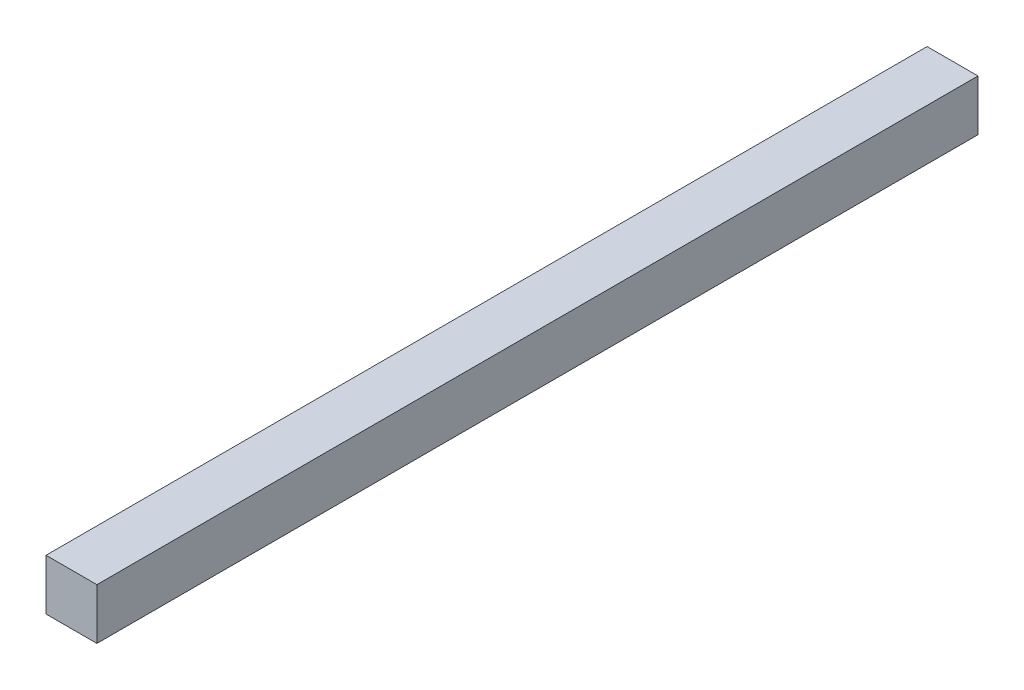
ISO-10303-21;
HEADER;
FILE_DESCRIPTION(('STEP AP214'),'2;1');
FILE_NAME('part.step','',(''),(''),'','','');
FILE_SCHEMA(('AUTOMOTIVE_DESIGN { 1 0 10303 214 1 1 1 1 }'));
ENDSEC;
DATA;
#1=APPLICATION_CONTEXT('core data for automotive mechanical design processes');
#2=APPLICATION_PROTOCOL_DEFINITION('international standard','automotive_design',2000,#1);
#3=PRODUCT_CONTEXT('',#1,'mechanical');
#4=PRODUCT('Part','Part','',(#3));
#5=PRODUCT_RELATED_PRODUCT_CATEGORY('part','',(#4));
#6=PRODUCT_DEFINITION_FORMATION('','',#4);
#7=PRODUCT_DEFINITION_CONTEXT('part definition',#1,'design');
#8=PRODUCT_DEFINITION('design','',#6,#7);
#9=PRODUCT_DEFINITION_SHAPE('','',#8);
#10=(LENGTH_UNIT() NAMED_UNIT(*) SI_UNIT(.MILLI.,.METRE.));
#11=(NAMED_UNIT(*) PLANE_ANGLE_UNIT() SI_UNIT($,.RADIAN.));
#12=(NAMED_UNIT(*) SI_UNIT($,.STERADIAN.) SOLID_ANGLE_UNIT());
#13=UNCERTAINTY_MEASURE_WITH_UNIT(LENGTH_MEASURE(1.E-05),#10,'distance_accuracy_value','');
#14=(GEOMETRIC_REPRESENTATION_CONTEXT(3) GLOBAL_UNCERTAINTY_ASSIGNED_CONTEXT((#13)) GLOBAL_UNIT_ASSIGNED_CONTEXT((#10,
#11,#12)) REPRESENTATION_CONTEXT('',''));
#15=CARTESIAN_POINT('',(0.,0.,0.));
#16=DIRECTION('',(0.,0.,1.));
#17=DIRECTION('',(1.,0.,0.));
#18=AXIS2_PLACEMENT_3D('',#15,#16,#17);
#19=CARTESIAN_POINT('',(1.27,12.25,-8.25));
#20=DIRECTION('',(0.,0.,-1.));
#21=DIRECTION('',(0.,-1.,0.));
#22=AXIS2_PLACEMENT_3D('',#19,#20,#21);
#23=PLANE('',#22);
#24=DIRECTION('',(-1.,0.,0.));
#25=VECTOR('',#24,1.);
#26=CARTESIAN_POINT('',(1.595,11.925,-8.25));
#27=LINE('',#26,#25);
#28=CARTESIAN_POINT('',(1.595,11.925,-8.25));
#29=VERTEX_POINT('',#28);
#30=CARTESIAN_POINT('',(0.945,11.925,-8.25));
#31=VERTEX_POINT('',#30);
#32=EDGE_CURVE('E11',#29,#31,#27,.T.);
#33=ORIENTED_EDGE('',*,*,#32,.T.);
#34=DIRECTION('',(0.,1.,0.));
#35=VECTOR('',#34,1.);
#36=CARTESIAN_POINT('',(0.945,11.925,-8.25));
#37=LINE('',#36,#35);
#38=CARTESIAN_POINT('',(0.945,12.575,-8.25));
#39=VERTEX_POINT('',#38);
#40=EDGE_CURVE('E27',#31,#39,#37,.T.);
#41=ORIENTED_EDGE('',*,*,#40,.T.);
#42=DIRECTION('',(1.,0.,0.));
#43=VECTOR('',#42,1.);
#44=CARTESIAN_POINT('',(0.945,12.575,-8.25));
#45=LINE('',#44,#43);
#46=CARTESIAN_POINT('',(1.595,12.575,-8.25));
#47=VERTEX_POINT('',#46);
#48=EDGE_CURVE('E67',#39,#47,#45,.T.);
#49=ORIENTED_EDGE('',*,*,#48,.T.);
#50=DIRECTION('',(0.,-1.,0.));
#51=VECTOR('',#50,1.);
#52=CARTESIAN_POINT('',(1.595,12.575,-8.25));
#53=LINE('',#52,#51);
#54=EDGE_CURVE('E64',#47,#29,#53,.T.);
#55=ORIENTED_EDGE('',*,*,#54,.T.);
#56=EDGE_LOOP('',(#33,#41,#49,#55));
#57=FACE_BOUND('',#56,.T.);
#58=ADVANCED_FACE('F16',(#57),#23,.T.);
#59=CARTESIAN_POINT('',(0.945,12.575,1.));
#60=DIRECTION('',(-1.,0.,0.));
#61=DIRECTION('',(0.,0.,1.));
#62=AXIS2_PLACEMENT_3D('',#59,#60,#61);
#63=PLANE('',#62);
#64=DIRECTION('',(0.,0.,-1.));
#65=VECTOR('',#64,1.);
#66=CARTESIAN_POINT('',(0.945,11.925,1.));
#67=LINE('',#66,#65);
#68=CARTESIAN_POINT('',(0.945,11.925,3.));
#69=VERTEX_POINT('',#68);
#70=EDGE_CURVE('E81',#69,#31,#67,.T.);
#71=ORIENTED_EDGE('',*,*,#70,.F.);
#72=DIRECTION('',(0.,-1.,0.));
#73=VECTOR('',#72,1.);
#74=CARTESIAN_POINT('',(0.945,11.925,3.));
#75=LINE('',#74,#73);
#76=CARTESIAN_POINT('',(0.945,12.575,3.));
#77=VERTEX_POINT('',#76);
#78=EDGE_CURVE('E20',#77,#69,#75,.T.);
#79=ORIENTED_EDGE('',*,*,#78,.F.);
#80=DIRECTION('',(0.,0.,1.));
#81=VECTOR('',#80,1.);
#82=CARTESIAN_POINT('',(0.945,12.575,1.));
#83=LINE('',#82,#81);
#84=EDGE_CURVE('E73',#39,#77,#83,.T.);
#85=ORIENTED_EDGE('',*,*,#84,.F.);
#86=ORIENTED_EDGE('',*,*,#40,.F.);
#87=EDGE_LOOP('',(#71,#79,#85,#86));
#88=FACE_BOUND('',#87,.T.);
#89=ADVANCED_FACE('F119',(#88),#63,.T.);
#90=CARTESIAN_POINT('',(1.595,12.575,1.));
#91=DIRECTION('',(0.,1.,0.));
#92=DIRECTION('',(1.,0.,0.));
#93=AXIS2_PLACEMENT_3D('',#90,#91,#92);
#94=PLANE('',#93);
#95=ORIENTED_EDGE('',*,*,#84,.T.);
#96=DIRECTION('',(-1.,0.,0.));
#97=VECTOR('',#96,1.);
#98=CARTESIAN_POINT('',(0.945,12.575,3.));
#99=LINE('',#98,#97);
#100=CARTESIAN_POINT('',(1.595,12.575,3.));
#101=VERTEX_POINT('',#100);
#102=EDGE_CURVE('E102',#101,#77,#99,.T.);
#103=ORIENTED_EDGE('',*,*,#102,.F.);
#104=DIRECTION('',(0.,0.,1.));
#105=VECTOR('',#104,1.);
#106=CARTESIAN_POINT('',(1.595,12.575,1.));
#107=LINE('',#106,#105);
#108=EDGE_CURVE('E86',#47,#101,#107,.T.);
#109=ORIENTED_EDGE('',*,*,#108,.F.);
#110=ORIENTED_EDGE('',*,*,#48,.F.);
#111=EDGE_LOOP('',(#95,#103,#109,#110));
#112=FACE_BOUND('',#111,.T.);
#113=ADVANCED_FACE('F168',(#112),#94,.T.);
#114=CARTESIAN_POINT('',(1.595,11.925,1.));
#115=DIRECTION('',(1.,0.,0.));
#116=DIRECTION('',(0.,1.,0.));
#117=AXIS2_PLACEMENT_3D('',#114,#115,#116);
#118=PLANE('',#117);
#119=ORIENTED_EDGE('',*,*,#108,.T.);
#120=DIRECTION('',(0.,1.,0.));
#121=VECTOR('',#120,1.);
#122=CARTESIAN_POINT('',(1.595,12.575,3.));
#123=LINE('',#122,#121);
#124=CARTESIAN_POINT('',(1.595,11.925,3.));
#125=VERTEX_POINT('',#124);
#126=EDGE_CURVE('E84',#125,#101,#123,.T.);
#127=ORIENTED_EDGE('',*,*,#126,.F.);
#128=DIRECTION('',(0.,0.,1.));
#129=VECTOR('',#128,1.);
#130=CARTESIAN_POINT('',(1.595,11.925,1.));
#131=LINE('',#130,#129);
#132=EDGE_CURVE('E79',#29,#125,#131,.T.);
#133=ORIENTED_EDGE('',*,*,#132,.F.);
#134=ORIENTED_EDGE('',*,*,#54,.F.);
#135=EDGE_LOOP('',(#119,#127,#133,#134));
#136=FACE_BOUND('',#135,.T.);
#137=ADVANCED_FACE('F82',(#136),#118,.T.);
#138=CARTESIAN_POINT('',(0.945,11.925,1.));
#139=DIRECTION('',(0.,-1.,0.));
#140=DIRECTION('',(0.,0.,-1.));
#141=AXIS2_PLACEMENT_3D('',#138,#139,#140);
#142=PLANE('',#141);
#143=ORIENTED_EDGE('',*,*,#132,.T.);
#144=DIRECTION('',(1.,0.,0.));
#145=VECTOR('',#144,1.);
#146=CARTESIAN_POINT('',(1.595,11.925,3.));
#147=LINE('',#146,#145);
#148=EDGE_CURVE('E94',#69,#125,#147,.T.);
#149=ORIENTED_EDGE('',*,*,#148,.F.);
#150=ORIENTED_EDGE('',*,*,#70,.T.);
#151=ORIENTED_EDGE('',*,*,#32,.F.);
#152=EDGE_LOOP('',(#143,#149,#150,#151));
#153=FACE_BOUND('',#152,.T.);
#154=ADVANCED_FACE('F77',(#153),#142,.T.);
#155=CARTESIAN_POINT('',(1.27,12.25,3.));
#156=DIRECTION('',(0.,0.,1.));
#157=DIRECTION('',(1.,0.,0.));
#158=AXIS2_PLACEMENT_3D('',#155,#156,#157);
#159=PLANE('',#158);
#160=ORIENTED_EDGE('',*,*,#148,.T.);
#161=ORIENTED_EDGE('',*,*,#126,.T.);
#162=ORIENTED_EDGE('',*,*,#102,.T.);
#163=ORIENTED_EDGE('',*,*,#78,.T.);
#164=EDGE_LOOP('',(#160,#161,#162,#163));
#165=FACE_BOUND('',#164,.T.);
#166=ADVANCED_FACE('F18',(#165),#159,.T.);
#167=CLOSED_SHELL('',(#58,#89,#113,#137,#154,#166));
#168=MANIFOLD_SOLID_BREP('B1',#167);
#169=ADVANCED_BREP_SHAPE_REPRESENTATION('',(#18,#168),#14);
#170=SHAPE_DEFINITION_REPRESENTATION(#9,#169);
ENDSEC;
END-ISO-10303-21;
